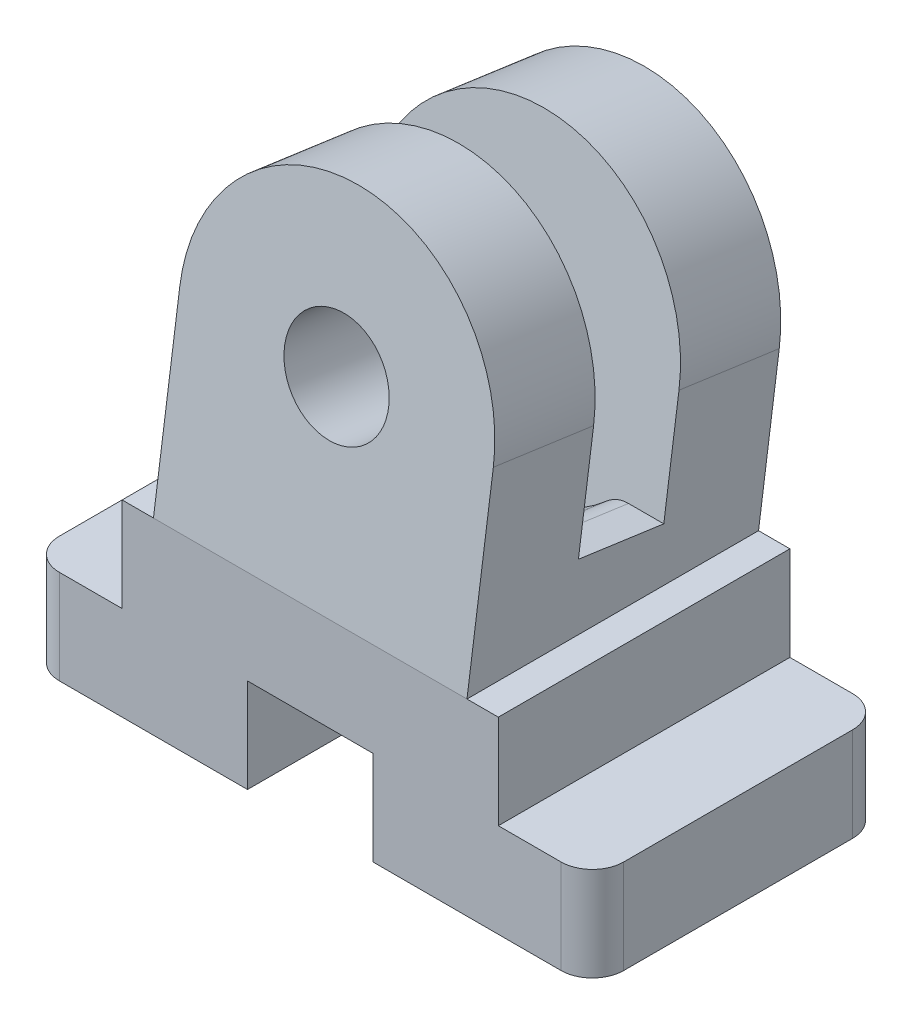
ISO-10303-21;
HEADER;
FILE_DESCRIPTION(('STEP AP214'),'2;1');
FILE_NAME('part.step','',(''),(''),'','','');
FILE_SCHEMA(('AUTOMOTIVE_DESIGN { 1 0 10303 214 1 1 1 1 }'));
ENDSEC;
DATA;
#1=APPLICATION_CONTEXT('core data for automotive mechanical design processes');
#2=APPLICATION_PROTOCOL_DEFINITION('international standard','automotive_design',2000,#1);
#3=PRODUCT_CONTEXT('',#1,'mechanical');
#4=PRODUCT('Part','Part','',(#3));
#5=PRODUCT_RELATED_PRODUCT_CATEGORY('part','',(#4));
#6=PRODUCT_DEFINITION_FORMATION('','',#4);
#7=PRODUCT_DEFINITION_CONTEXT('part definition',#1,'design');
#8=PRODUCT_DEFINITION('design','',#6,#7);
#9=PRODUCT_DEFINITION_SHAPE('','',#8);
#10=(LENGTH_UNIT() NAMED_UNIT(*) SI_UNIT(.MILLI.,.METRE.));
#11=(NAMED_UNIT(*) PLANE_ANGLE_UNIT() SI_UNIT($,.RADIAN.));
#12=(NAMED_UNIT(*) SI_UNIT($,.STERADIAN.) SOLID_ANGLE_UNIT());
#13=UNCERTAINTY_MEASURE_WITH_UNIT(LENGTH_MEASURE(1.E-05),#10,'distance_accuracy_value','');
#14=(GEOMETRIC_REPRESENTATION_CONTEXT(3) GLOBAL_UNCERTAINTY_ASSIGNED_CONTEXT((#13)) GLOBAL_UNIT_ASSIGNED_CONTEXT((#10,
#11,#12)) REPRESENTATION_CONTEXT('',''));
#15=CARTESIAN_POINT('',(0.,0.,0.));
#16=DIRECTION('',(0.,0.,1.));
#17=DIRECTION('',(1.,0.,0.));
#18=AXIS2_PLACEMENT_3D('',#15,#16,#17);
#19=CARTESIAN_POINT('',(-5.,0.307577926005134,2.18853066197066));
#20=DIRECTION('',(0.,0.139173100960066,0.99026806874157));
#21=DIRECTION('',(0.,-0.99026806874157,0.139173100960066));
#22=AXIS2_PLACEMENT_3D('',#19,#20,#21);
#23=PLANE('',#22);
#24=CARTESIAN_POINT('',(0.,11.5321199850963,0.611024151833874));
#25=DIRECTION('',(0.,0.139173100960066,0.99026806874157));
#26=DIRECTION('',(0.,-0.99026806874157,0.139173100960066));
#27=AXIS2_PLACEMENT_3D('',#24,#25,#26);
#28=CIRCLE('',#27,1.6625);
#29=CARTESIAN_POINT('',(0.,9.88579932081348,0.842399432179984));
#30=VERTEX_POINT('',#29);
#31=EDGE_CURVE('E585',#30,#30,#28,.T.);
#32=ORIENTED_EDGE('',*,*,#31,.T.);
#33=EDGE_LOOP('',(#32));
#34=FACE_BOUND('',#33,.T.);
#35=DIRECTION('',(1.,0.,0.));
#36=VECTOR('',#35,1.);
#37=CARTESIAN_POINT('',(3.48250089734375,8.08351054709297,1.09569460081341));
#38=LINE('',#37,#36);
#39=CARTESIAN_POINT('',(3.87463684818494,8.08351054709297,1.09569460081341));
#40=VERTEX_POINT('',#39);
#41=CARTESIAN_POINT('',(5.,8.08351054709297,1.09569460081341));
#42=VERTEX_POINT('',#41);
#43=EDGE_CURVE('E568',#40,#42,#38,.T.);
#44=ORIENTED_EDGE('',*,*,#43,.F.);
#45=CARTESIAN_POINT('',(3.87463684818494,7.0932424783514,1.23486770177348));
#46=DIRECTION('',(0.,0.139173100960066,0.99026806874157));
#47=DIRECTION('',(0.,-0.99026806874157,0.139173100960066));
#48=AXIS2_PLACEMENT_3D('',#45,#46,#47);
#49=CIRCLE('',#48,1.);
#50=CARTESIAN_POINT('',(3.22068970081196,7.84242011662059,1.12957765115076));
#51=VERTEX_POINT('',#50);
#52=EDGE_CURVE('E86',#40,#51,#49,.T.);
#53=ORIENTED_EDGE('',*,*,#52,.T.);
#54=CARTESIAN_POINT('',(0.,11.5321199850963,0.611024151833875));
#55=DIRECTION('',(0.,0.139173100960066,0.99026806874157));
#56=DIRECTION('',(0.,-0.99026806874157,0.139173100960066));
#57=AXIS2_PLACEMENT_3D('',#54,#55,#56);
#58=CIRCLE('',#57,4.925);
#59=CARTESIAN_POINT('',(-3.22068970081196,7.84242011662059,1.12957765115076));
#60=VERTEX_POINT('',#59);
#61=EDGE_CURVE('E567',#60,#51,#58,.T.);
#62=ORIENTED_EDGE('',*,*,#61,.F.);
#63=CARTESIAN_POINT('',(-3.87463684818494,7.0932424783514,1.23486770177348));
#64=DIRECTION('',(0.,0.139173100960066,0.99026806874157));
#65=DIRECTION('',(0.,-0.99026806874157,0.139173100960066));
#66=AXIS2_PLACEMENT_3D('',#63,#64,#65);
#67=CIRCLE('',#66,1.);
#68=CARTESIAN_POINT('',(-3.87463684818494,8.08351054709297,1.09569460081341));
#69=VERTEX_POINT('',#68);
#70=EDGE_CURVE('E561',#60,#69,#67,.T.);
#71=ORIENTED_EDGE('',*,*,#70,.T.);
#72=DIRECTION('',(1.,0.,0.));
#73=VECTOR('',#72,1.);
#74=CARTESIAN_POINT('',(-3.48250089734375,8.08351054709297,1.09569460081341));
#75=LINE('',#74,#73);
#76=CARTESIAN_POINT('',(-5.,8.08351054709297,1.09569460081341));
#77=VERTEX_POINT('',#76);
#78=EDGE_CURVE('E274',#77,#69,#75,.T.);
#79=ORIENTED_EDGE('',*,*,#78,.F.);
#80=DIRECTION('',(0.,-0.99026806874157,0.139173100960066));
#81=VECTOR('',#80,1.);
#82=CARTESIAN_POINT('',(-5.,0.307577926005134,2.18853066197066));
#83=LINE('',#82,#81);
#84=CARTESIAN_POINT('',(-5.,11.5321199850963,0.611024151833876));
#85=VERTEX_POINT('',#84);
#86=EDGE_CURVE('E270',#85,#77,#83,.T.);
#87=ORIENTED_EDGE('',*,*,#86,.F.);
#88=CARTESIAN_POINT('',(0.,11.5321199850963,0.611024151833877));
#89=DIRECTION('',(0.,0.139173100960066,0.99026806874157));
#90=DIRECTION('',(0.,-0.99026806874157,0.139173100960066));
#91=AXIS2_PLACEMENT_3D('',#88,#89,#90);
#92=CIRCLE('',#91,5.);
#93=CARTESIAN_POINT('',(5.,11.5321199850964,0.611024151833878));
#94=VERTEX_POINT('',#93);
#95=EDGE_CURVE('E459',#94,#85,#92,.T.);
#96=ORIENTED_EDGE('',*,*,#95,.F.);
#97=DIRECTION('',(0.,-0.99026806874157,0.139173100960066));
#98=VECTOR('',#97,1.);
#99=CARTESIAN_POINT('',(5.,0.307577926005134,2.18853066197066));
#100=LINE('',#99,#98);
#101=EDGE_CURVE('E321',#94,#42,#100,.T.);
#102=ORIENTED_EDGE('',*,*,#101,.T.);
#103=EDGE_LOOP('',(#44,#53,#62,#71,#79,#87,#96,#102));
#104=FACE_BOUND('',#103,.T.);
#105=ADVANCED_FACE('F78',(#34,#104),#23,.F.);
#106=CARTESIAN_POINT('',(-5.,-0.0751481016350465,-0.53470652706866));
#107=DIRECTION('',(0.,-0.139173100960066,-0.99026806874157));
#108=DIRECTION('',(0.,0.99026806874157,-0.139173100960066));
#109=AXIS2_PLACEMENT_3D('',#106,#107,#108);
#110=PLANE('',#109);
#111=CARTESIAN_POINT('',(0.,11.1493939574562,-2.11221303720544));
#112=DIRECTION('',(0.,-0.139173100960066,-0.99026806874157));
#113=DIRECTION('',(0.,0.99026806874157,-0.139173100960066));
#114=AXIS2_PLACEMENT_3D('',#111,#112,#113);
#115=CIRCLE('',#114,1.6625);
#116=CARTESIAN_POINT('',(0.,12.795714621739,-2.34358831755155));
#117=VERTEX_POINT('',#116);
#118=EDGE_CURVE('E582',#117,#117,#115,.T.);
#119=ORIENTED_EDGE('',*,*,#118,.T.);
#120=EDGE_LOOP('',(#119));
#121=FACE_BOUND('',#120,.T.);
#122=CARTESIAN_POINT('',(0.,11.1493939574562,-2.11221303720544));
#123=DIRECTION('',(0.,-0.139173100960066,-0.99026806874157));
#124=DIRECTION('',(0.,0.99026806874157,-0.139173100960066));
#125=AXIS2_PLACEMENT_3D('',#122,#123,#124);
#126=CIRCLE('',#125,4.925);
#127=CARTESIAN_POINT('',(-3.22068970081196,7.45969408898041,-1.59365953788855));
#128=VERTEX_POINT('',#127);
#129=CARTESIAN_POINT('',(3.22068970081196,7.45969408898041,-1.59365953788855));
#130=VERTEX_POINT('',#129);
#131=EDGE_CURVE('E283',#128,#130,#126,.F.);
#132=ORIENTED_EDGE('',*,*,#131,.T.);
#133=CARTESIAN_POINT('',(3.87463684818494,6.71051645071122,-1.48836948726584));
#134=DIRECTION('',(0.,-0.139173100960066,-0.99026806874157));
#135=DIRECTION('',(0.,0.99026806874157,-0.139173100960066));
#136=AXIS2_PLACEMENT_3D('',#133,#134,#135);
#137=CIRCLE('',#136,1.);
#138=CARTESIAN_POINT('',(3.87463684818494,7.70078451945279,-1.6275425882259));
#139=VERTEX_POINT('',#138);
#140=EDGE_CURVE('E12',#130,#139,#137,.T.);
#141=ORIENTED_EDGE('',*,*,#140,.T.);
#142=DIRECTION('',(1.,0.,0.));
#143=VECTOR('',#142,1.);
#144=CARTESIAN_POINT('',(3.48250089734375,7.70078451945279,-1.6275425882259));
#145=LINE('',#144,#143);
#146=CARTESIAN_POINT('',(5.,7.70078451945279,-1.6275425882259));
#147=VERTEX_POINT('',#146);
#148=EDGE_CURVE('E462',#139,#147,#145,.T.);
#149=ORIENTED_EDGE('',*,*,#148,.T.);
#150=DIRECTION('',(0.,0.99026806874157,-0.139173100960066));
#151=VECTOR('',#150,1.);
#152=CARTESIAN_POINT('',(5.,-0.0751481016350465,-0.53470652706866));
#153=LINE('',#152,#151);
#154=CARTESIAN_POINT('',(5.,11.1493939574562,-2.11221303720544));
#155=VERTEX_POINT('',#154);
#156=EDGE_CURVE('E296',#147,#155,#153,.T.);
#157=ORIENTED_EDGE('',*,*,#156,.T.);
#158=CARTESIAN_POINT('',(0.,11.1493939574562,-2.11221303720544));
#159=DIRECTION('',(0.,-0.139173100960066,-0.99026806874157));
#160=DIRECTION('',(0.,0.99026806874157,-0.139173100960066));
#161=AXIS2_PLACEMENT_3D('',#158,#159,#160);
#162=CIRCLE('',#161,5.);
#163=CARTESIAN_POINT('',(-5.,11.1493939574562,-2.11221303720544));
#164=VERTEX_POINT('',#163);
#165=EDGE_CURVE('E288',#164,#155,#162,.T.);
#166=ORIENTED_EDGE('',*,*,#165,.F.);
#167=DIRECTION('',(0.,0.99026806874157,-0.139173100960066));
#168=VECTOR('',#167,1.);
#169=CARTESIAN_POINT('',(-5.,-0.0751481016350465,-0.53470652706866));
#170=LINE('',#169,#168);
#171=CARTESIAN_POINT('',(-5.,7.70078451945279,-1.6275425882259));
#172=VERTEX_POINT('',#171);
#173=EDGE_CURVE('E266',#172,#164,#170,.T.);
#174=ORIENTED_EDGE('',*,*,#173,.F.);
#175=DIRECTION('',(1.,0.,0.));
#176=VECTOR('',#175,1.);
#177=CARTESIAN_POINT('',(-3.48250089734375,7.70078451945279,-1.6275425882259));
#178=LINE('',#177,#176);
#179=CARTESIAN_POINT('',(-3.87463684818494,7.70078451945279,-1.6275425882259));
#180=VERTEX_POINT('',#179);
#181=EDGE_CURVE('E278',#172,#180,#178,.T.);
#182=ORIENTED_EDGE('',*,*,#181,.T.);
#183=CARTESIAN_POINT('',(-3.87463684818494,6.71051645071122,-1.48836948726584));
#184=DIRECTION('',(0.,-0.139173100960066,-0.99026806874157));
#185=DIRECTION('',(0.,0.99026806874157,-0.139173100960066));
#186=AXIS2_PLACEMENT_3D('',#183,#184,#185);
#187=CIRCLE('',#186,1.);
#188=EDGE_CURVE('E563',#180,#128,#187,.T.);
#189=ORIENTED_EDGE('',*,*,#188,.T.);
#190=EDGE_LOOP('',(#132,#141,#149,#157,#166,#174,#182,#189));
#191=FACE_BOUND('',#190,.T.);
#192=ADVANCED_FACE('F286',(#121,#191),#110,.F.);
#193=CARTESIAN_POINT('',(0.,6.,0.));
#194=DIRECTION('',(0.,1.,0.));
#195=DIRECTION('',(0.,0.,1.));
#196=AXIS2_PLACEMENT_3D('',#193,#194,#195);
#197=PLANE('',#196);
#198=DIRECTION('',(-1.,0.,0.));
#199=VECTOR('',#198,1.);
#200=CARTESIAN_POINT('',(-6.,6.,-4.65));
#201=LINE('',#200,#199);
#202=CARTESIAN_POINT('',(6.,6.,-4.65));
#203=VERTEX_POINT('',#202);
#204=CARTESIAN_POINT('',(5.,6.,-4.65));
#205=VERTEX_POINT('',#204);
#206=EDGE_CURVE('E338',#203,#205,#201,.T.);
#207=ORIENTED_EDGE('',*,*,#206,.T.);
#208=DIRECTION('',(0.,0.,1.));
#209=VECTOR('',#208,1.);
#210=CARTESIAN_POINT('',(5.,6.,0.));
#211=LINE('',#210,#209);
#212=CARTESIAN_POINT('',(5.,6.,4.65));
#213=VERTEX_POINT('',#212);
#214=EDGE_CURVE('E326',#205,#213,#211,.T.);
#215=ORIENTED_EDGE('',*,*,#214,.T.);
#216=DIRECTION('',(1.,0.,0.));
#217=VECTOR('',#216,1.);
#218=CARTESIAN_POINT('',(-6.,6.,4.65));
#219=LINE('',#218,#217);
#220=CARTESIAN_POINT('',(6.,6.,4.65));
#221=VERTEX_POINT('',#220);
#222=EDGE_CURVE('E374',#213,#221,#219,.T.);
#223=ORIENTED_EDGE('',*,*,#222,.T.);
#224=DIRECTION('',(0.,0.,-1.));
#225=VECTOR('',#224,1.);
#226=CARTESIAN_POINT('',(6.,6.,-4.65));
#227=LINE('',#226,#225);
#228=EDGE_CURVE('E348',#221,#203,#227,.T.);
#229=ORIENTED_EDGE('',*,*,#228,.T.);
#230=EDGE_LOOP('',(#207,#215,#223,#229));
#231=FACE_BOUND('',#230,.T.);
#232=ADVANCED_FACE('F437',(#231),#197,.T.);
#233=DIRECTION('',(0.,0.,1.));
#234=VECTOR('',#233,1.);
#235=CARTESIAN_POINT('',(-5.,6.,0.));
#236=LINE('',#235,#234);
#237=CARTESIAN_POINT('',(-5.,6.,-4.65));
#238=VERTEX_POINT('',#237);
#239=CARTESIAN_POINT('',(-5.,6.,4.65));
#240=VERTEX_POINT('',#239);
#241=EDGE_CURVE('E335',#238,#240,#236,.T.);
#242=ORIENTED_EDGE('',*,*,#241,.F.);
#243=CARTESIAN_POINT('',(-6.,6.,-4.65));
#244=VERTEX_POINT('',#243);
#245=EDGE_CURVE('E343',#238,#244,#201,.T.);
#246=ORIENTED_EDGE('',*,*,#245,.T.);
#247=DIRECTION('',(0.,0.,1.));
#248=VECTOR('',#247,1.);
#249=CARTESIAN_POINT('',(-6.,6.,-4.65));
#250=LINE('',#249,#248);
#251=CARTESIAN_POINT('',(-6.,6.,4.65));
#252=VERTEX_POINT('',#251);
#253=EDGE_CURVE('E360',#244,#252,#250,.T.);
#254=ORIENTED_EDGE('',*,*,#253,.T.);
#255=EDGE_CURVE('E370',#252,#240,#219,.T.);
#256=ORIENTED_EDGE('',*,*,#255,.T.);
#257=EDGE_LOOP('',(#242,#246,#254,#256));
#258=FACE_BOUND('',#257,.T.);
#259=ADVANCED_FACE('F393',(#258),#197,.T.);
#260=CARTESIAN_POINT('',(0.,3.,0.));
#261=DIRECTION('',(0.,1.,0.));
#262=DIRECTION('',(0.,0.,1.));
#263=AXIS2_PLACEMENT_3D('',#260,#261,#262);
#264=PLANE('',#263);
#265=DIRECTION('',(0.,0.,-1.));
#266=VECTOR('',#265,1.);
#267=CARTESIAN_POINT('',(9.,3.,-4.65));
#268=LINE('',#267,#266);
#269=CARTESIAN_POINT('',(9.,3.,3.65));
#270=VERTEX_POINT('',#269);
#271=CARTESIAN_POINT('',(9.,3.,-3.65));
#272=VERTEX_POINT('',#271);
#273=EDGE_CURVE('E471',#270,#272,#268,.T.);
#274=ORIENTED_EDGE('',*,*,#273,.T.);
#275=CARTESIAN_POINT('',(8.,3.,-3.65));
#276=DIRECTION('',(0.,1.,0.));
#277=DIRECTION('',(0.,0.,1.));
#278=AXIS2_PLACEMENT_3D('',#275,#276,#277);
#279=CIRCLE('',#278,1.);
#280=CARTESIAN_POINT('',(8.,3.,-4.65));
#281=VERTEX_POINT('',#280);
#282=EDGE_CURVE('E301',#272,#281,#279,.T.);
#283=ORIENTED_EDGE('',*,*,#282,.T.);
#284=DIRECTION('',(-1.,0.,0.));
#285=VECTOR('',#284,1.);
#286=CARTESIAN_POINT('',(-9.,3.,-4.65));
#287=LINE('',#286,#285);
#288=CARTESIAN_POINT('',(6.,3.,-4.65));
#289=VERTEX_POINT('',#288);
#290=EDGE_CURVE('E467',#281,#289,#287,.T.);
#291=ORIENTED_EDGE('',*,*,#290,.T.);
#292=DIRECTION('',(0.,0.,-1.));
#293=VECTOR('',#292,1.);
#294=CARTESIAN_POINT('',(6.,3.,-4.65));
#295=LINE('',#294,#293);
#296=CARTESIAN_POINT('',(6.,3.,4.65));
#297=VERTEX_POINT('',#296);
#298=EDGE_CURVE('E356',#297,#289,#295,.T.);
#299=ORIENTED_EDGE('',*,*,#298,.F.);
#300=DIRECTION('',(1.,0.,0.));
#301=VECTOR('',#300,1.);
#302=CARTESIAN_POINT('',(-9.,3.,4.65));
#303=LINE('',#302,#301);
#304=CARTESIAN_POINT('',(8.,3.,4.65));
#305=VERTEX_POINT('',#304);
#306=EDGE_CURVE('E622',#297,#305,#303,.T.);
#307=ORIENTED_EDGE('',*,*,#306,.T.);
#308=CARTESIAN_POINT('',(8.,3.,3.65));
#309=DIRECTION('',(0.,1.,0.));
#310=DIRECTION('',(0.,0.,1.));
#311=AXIS2_PLACEMENT_3D('',#308,#309,#310);
#312=CIRCLE('',#311,1.);
#313=EDGE_CURVE('E544',#305,#270,#312,.T.);
#314=ORIENTED_EDGE('',*,*,#313,.T.);
#315=EDGE_LOOP('',(#274,#283,#291,#299,#307,#314));
#316=FACE_BOUND('',#315,.T.);
#317=ADVANCED_FACE('F663',(#316),#264,.T.);
#318=CARTESIAN_POINT('',(0.,0.,0.));
#319=DIRECTION('',(0.,1.,0.));
#320=DIRECTION('',(0.,0.,1.));
#321=AXIS2_PLACEMENT_3D('',#318,#319,#320);
#322=PLANE('',#321);
#323=DIRECTION('',(-1.,0.,0.));
#324=VECTOR('',#323,1.);
#325=CARTESIAN_POINT('',(-9.,0.,-4.65));
#326=LINE('',#325,#324);
#327=CARTESIAN_POINT('',(8.,0.,-4.65));
#328=VERTEX_POINT('',#327);
#329=CARTESIAN_POINT('',(2.,0.,-4.65));
#330=VERTEX_POINT('',#329);
#331=EDGE_CURVE('E487',#328,#330,#326,.T.);
#332=ORIENTED_EDGE('',*,*,#331,.F.);
#333=CARTESIAN_POINT('',(8.,0.,-3.65));
#334=DIRECTION('',(0.,1.,0.));
#335=DIRECTION('',(0.,0.,1.));
#336=AXIS2_PLACEMENT_3D('',#333,#334,#335);
#337=CIRCLE('',#336,1.);
#338=CARTESIAN_POINT('',(9.,0.,-3.65));
#339=VERTEX_POINT('',#338);
#340=EDGE_CURVE('E538',#328,#339,#337,.F.);
#341=ORIENTED_EDGE('',*,*,#340,.T.);
#342=DIRECTION('',(0.,0.,-1.));
#343=VECTOR('',#342,1.);
#344=CARTESIAN_POINT('',(9.,0.,-4.65));
#345=LINE('',#344,#343);
#346=CARTESIAN_POINT('',(9.,0.,3.65));
#347=VERTEX_POINT('',#346);
#348=EDGE_CURVE('E492',#347,#339,#345,.T.);
#349=ORIENTED_EDGE('',*,*,#348,.F.);
#350=CARTESIAN_POINT('',(8.,0.,3.65));
#351=DIRECTION('',(0.,1.,0.));
#352=DIRECTION('',(0.,0.,1.));
#353=AXIS2_PLACEMENT_3D('',#350,#351,#352);
#354=CIRCLE('',#353,1.);
#355=CARTESIAN_POINT('',(8.,0.,4.65));
#356=VERTEX_POINT('',#355);
#357=EDGE_CURVE('E536',#347,#356,#354,.F.);
#358=ORIENTED_EDGE('',*,*,#357,.T.);
#359=DIRECTION('',(1.,0.,0.));
#360=VECTOR('',#359,1.);
#361=CARTESIAN_POINT('',(-9.,0.,4.65));
#362=LINE('',#361,#360);
#363=CARTESIAN_POINT('',(2.,0.,4.65));
#364=VERTEX_POINT('',#363);
#365=EDGE_CURVE('E495',#364,#356,#362,.T.);
#366=ORIENTED_EDGE('',*,*,#365,.F.);
#367=DIRECTION('',(0.,0.,1.));
#368=VECTOR('',#367,1.);
#369=CARTESIAN_POINT('',(2.,0.,4.65));
#370=LINE('',#369,#368);
#371=EDGE_CURVE('E589',#330,#364,#370,.T.);
#372=ORIENTED_EDGE('',*,*,#371,.F.);
#373=EDGE_LOOP('',(#332,#341,#349,#358,#366,#372));
#374=FACE_BOUND('',#373,.T.);
#375=ADVANCED_FACE('F613',(#374),#322,.F.);
#376=CARTESIAN_POINT('',(-5.,0.757071764459568,5.38684551050759));
#377=DIRECTION('',(0.,-0.139173100960066,-0.99026806874157));
#378=DIRECTION('',(0.,0.99026806874157,-0.139173100960066));
#379=AXIS2_PLACEMENT_3D('',#376,#377,#378);
#380=PLANE('',#379);
#381=CARTESIAN_POINT('',(0.,11.9816138235508,3.80933900037081));
#382=DIRECTION('',(0.,0.139173100960066,0.99026806874157));
#383=DIRECTION('',(0.,-0.99026806874157,0.139173100960066));
#384=AXIS2_PLACEMENT_3D('',#381,#382,#383);
#385=CIRCLE('',#384,1.6625);
#386=CARTESIAN_POINT('',(0.,10.3352931592679,4.04071428071692));
#387=VERTEX_POINT('',#386);
#388=EDGE_CURVE('E574',#387,#387,#385,.T.);
#389=ORIENTED_EDGE('',*,*,#388,.F.);
#390=EDGE_LOOP('',(#389));
#391=FACE_BOUND('',#390,.T.);
#392=DIRECTION('',(0.,0.99026806874157,-0.139173100960066));
#393=VECTOR('',#392,1.);
#394=CARTESIAN_POINT('',(5.,0.757071764459568,5.38684551050759));
#395=LINE('',#394,#393);
#396=CARTESIAN_POINT('',(5.,11.9816138235508,3.80933900037081));
#397=VERTEX_POINT('',#396);
#398=EDGE_CURVE('E325',#213,#397,#395,.T.);
#399=ORIENTED_EDGE('',*,*,#398,.T.);
#400=CARTESIAN_POINT('',(0.,11.9816138235508,3.80933900037081));
#401=DIRECTION('',(0.,0.139173100960066,0.99026806874157));
#402=DIRECTION('',(0.,-0.99026806874157,0.139173100960066));
#403=AXIS2_PLACEMENT_3D('',#400,#401,#402);
#404=CIRCLE('',#403,5.);
#405=CARTESIAN_POINT('',(-5.,11.9816138235508,3.80933900037081));
#406=VERTEX_POINT('',#405);
#407=EDGE_CURVE('E423',#397,#406,#404,.T.);
#408=ORIENTED_EDGE('',*,*,#407,.T.);
#409=DIRECTION('',(0.,0.99026806874157,-0.139173100960066));
#410=VECTOR('',#409,1.);
#411=CARTESIAN_POINT('',(-5.,0.757071764459568,5.38684551050759));
#412=LINE('',#411,#410);
#413=EDGE_CURVE('E418',#240,#406,#412,.T.);
#414=ORIENTED_EDGE('',*,*,#413,.F.);
#415=DIRECTION('',(1.,0.,0.));
#416=VECTOR('',#415,1.);
#417=CARTESIAN_POINT('',(-5.,6.,4.65));
#418=LINE('',#417,#416);
#419=EDGE_CURVE('E413',#240,#213,#418,.T.);
#420=ORIENTED_EDGE('',*,*,#419,.T.);
#421=EDGE_LOOP('',(#399,#408,#414,#420));
#422=FACE_BOUND('',#421,.T.);
#423=ADVANCED_FACE('F422',(#391,#422),#380,.F.);
#424=CARTESIAN_POINT('',(-5.,-0.52464194008948,-3.73302137560559));
#425=DIRECTION('',(0.,0.139173100960066,0.99026806874157));
#426=DIRECTION('',(0.,-0.99026806874157,0.139173100960066));
#427=AXIS2_PLACEMENT_3D('',#424,#425,#426);
#428=PLANE('',#427);
#429=CARTESIAN_POINT('',(0.,10.6999001190017,-5.31052788574237));
#430=DIRECTION('',(0.,0.139173100960066,0.99026806874157));
#431=DIRECTION('',(0.,-0.99026806874157,0.139173100960066));
#432=AXIS2_PLACEMENT_3D('',#429,#430,#431);
#433=CIRCLE('',#432,1.6625);
#434=CARTESIAN_POINT('',(0.,9.05357945471887,-5.07915260539626));
#435=VERTEX_POINT('',#434);
#436=EDGE_CURVE('E327',#435,#435,#433,.T.);
#437=ORIENTED_EDGE('',*,*,#436,.T.);
#438=EDGE_LOOP('',(#437));
#439=FACE_BOUND('',#438,.T.);
#440=CARTESIAN_POINT('',(0.,10.6999001190017,-5.31052788574237));
#441=DIRECTION('',(0.,0.139173100960066,0.99026806874157));
#442=DIRECTION('',(0.,-0.99026806874157,0.139173100960066));
#443=AXIS2_PLACEMENT_3D('',#440,#441,#442);
#444=CIRCLE('',#443,5.);
#445=CARTESIAN_POINT('',(5.,10.6999001190017,-5.31052788574237));
#446=VERTEX_POINT('',#445);
#447=CARTESIAN_POINT('',(-5.,10.6999001190017,-5.31052788574237));
#448=VERTEX_POINT('',#447);
#449=EDGE_CURVE('E456',#446,#448,#444,.T.);
#450=ORIENTED_EDGE('',*,*,#449,.F.);
#451=DIRECTION('',(0.,-0.99026806874157,0.139173100960066));
#452=VECTOR('',#451,1.);
#453=CARTESIAN_POINT('',(5.,-0.52464194008948,-3.73302137560559));
#454=LINE('',#453,#452);
#455=EDGE_CURVE('E290',#446,#205,#454,.T.);
#456=ORIENTED_EDGE('',*,*,#455,.T.);
#457=DIRECTION('',(1.,0.,0.));
#458=VECTOR('',#457,1.);
#459=CARTESIAN_POINT('',(-5.,6.,-4.65));
#460=LINE('',#459,#458);
#461=EDGE_CURVE('E293',#238,#205,#460,.T.);
#462=ORIENTED_EDGE('',*,*,#461,.F.);
#463=DIRECTION('',(0.,-0.99026806874157,0.139173100960066));
#464=VECTOR('',#463,1.);
#465=CARTESIAN_POINT('',(-5.,-0.52464194008948,-3.73302137560559));
#466=LINE('',#465,#464);
#467=EDGE_CURVE('E289',#448,#238,#466,.T.);
#468=ORIENTED_EDGE('',*,*,#467,.F.);
#469=EDGE_LOOP('',(#450,#456,#462,#468));
#470=FACE_BOUND('',#469,.T.);
#471=ADVANCED_FACE('F433',(#439,#470),#428,.F.);
#472=CARTESIAN_POINT('',(5.,0.,0.));
#473=DIRECTION('',(1.,0.,0.));
#474=DIRECTION('',(0.,0.,-1.));
#475=AXIS2_PLACEMENT_3D('',#472,#473,#474);
#476=PLANE('',#475);
#477=ORIENTED_EDGE('',*,*,#455,.F.);
#478=DIRECTION('',(0.,0.139173100960066,0.99026806874157));
#479=VECTOR('',#478,1.);
#480=CARTESIAN_POINT('',(5.,10.3967454175413,-7.46758566971223));
#481=LINE('',#480,#479);
#482=EDGE_CURVE('E316',#446,#155,#481,.T.);
#483=ORIENTED_EDGE('',*,*,#482,.T.);
#484=ORIENTED_EDGE('',*,*,#156,.F.);
#485=DIRECTION('',(0.,0.139173100960066,0.99026806874157));
#486=VECTOR('',#485,1.);
#487=CARTESIAN_POINT('',(5.,6.27858278742775,-11.7470337313992));
#488=LINE('',#487,#486);
#489=EDGE_CURVE('E275',#147,#42,#488,.T.);
#490=ORIENTED_EDGE('',*,*,#489,.T.);
#491=ORIENTED_EDGE('',*,*,#101,.F.);
#492=DIRECTION('',(0.,0.139173100960066,0.99026806874157));
#493=VECTOR('',#492,1.);
#494=CARTESIAN_POINT('',(5.,10.3967454175413,-7.46758566971223));
#495=LINE('',#494,#493);
#496=EDGE_CURVE('E443',#94,#397,#495,.T.);
#497=ORIENTED_EDGE('',*,*,#496,.T.);
#498=ORIENTED_EDGE('',*,*,#398,.F.);
#499=ORIENTED_EDGE('',*,*,#214,.F.);
#500=EDGE_LOOP('',(#477,#483,#484,#490,#491,#497,#498,#499));
#501=FACE_BOUND('',#500,.T.);
#502=ADVANCED_FACE('F439',(#501),#476,.T.);
#503=CARTESIAN_POINT('',(-5.,0.,0.));
#504=DIRECTION('',(1.,0.,0.));
#505=DIRECTION('',(0.,0.,-1.));
#506=AXIS2_PLACEMENT_3D('',#503,#504,#505);
#507=PLANE('',#506);
#508=DIRECTION('',(0.,0.139173100960066,0.99026806874157));
#509=VECTOR('',#508,1.);
#510=CARTESIAN_POINT('',(-5.,10.3967454175413,-7.46758566971223));
#511=LINE('',#510,#509);
#512=EDGE_CURVE('E320',#448,#164,#511,.T.);
#513=ORIENTED_EDGE('',*,*,#512,.F.);
#514=ORIENTED_EDGE('',*,*,#467,.T.);
#515=ORIENTED_EDGE('',*,*,#241,.T.);
#516=ORIENTED_EDGE('',*,*,#413,.T.);
#517=DIRECTION('',(0.,0.139173100960066,0.99026806874157));
#518=VECTOR('',#517,1.);
#519=CARTESIAN_POINT('',(-5.,10.3967454175413,-7.46758566971223));
#520=LINE('',#519,#518);
#521=EDGE_CURVE('E448',#85,#406,#520,.T.);
#522=ORIENTED_EDGE('',*,*,#521,.F.);
#523=ORIENTED_EDGE('',*,*,#86,.T.);
#524=DIRECTION('',(0.,0.139173100960066,0.99026806874157));
#525=VECTOR('',#524,1.);
#526=CARTESIAN_POINT('',(-5.,6.27858278742775,-11.7470337313992));
#527=LINE('',#526,#525);
#528=EDGE_CURVE('E261',#172,#77,#527,.T.);
#529=ORIENTED_EDGE('',*,*,#528,.F.);
#530=ORIENTED_EDGE('',*,*,#173,.T.);
#531=EDGE_LOOP('',(#513,#514,#515,#516,#522,#523,#529,#530));
#532=FACE_BOUND('',#531,.T.);
#533=ADVANCED_FACE('F264',(#532),#507,.F.);
#534=CARTESIAN_POINT('',(-6.,3.,-4.65));
#535=VERTEX_POINT('',#534);
#536=CARTESIAN_POINT('',(-8.,3.,-4.65));
#537=VERTEX_POINT('',#536);
#538=EDGE_CURVE('E402',#535,#537,#287,.T.);
#539=ORIENTED_EDGE('',*,*,#538,.T.);
#540=CARTESIAN_POINT('',(-8.,3.,-3.65));
#541=DIRECTION('',(0.,1.,0.));
#542=DIRECTION('',(0.,0.,1.));
#543=AXIS2_PLACEMENT_3D('',#540,#541,#542);
#544=CIRCLE('',#543,1.);
#545=CARTESIAN_POINT('',(-9.,3.,-3.65));
#546=VERTEX_POINT('',#545);
#547=EDGE_CURVE('E528',#537,#546,#544,.T.);
#548=ORIENTED_EDGE('',*,*,#547,.T.);
#549=DIRECTION('',(0.,0.,1.));
#550=VECTOR('',#549,1.);
#551=CARTESIAN_POINT('',(-9.,3.,-4.65));
#552=LINE('',#551,#550);
#553=CARTESIAN_POINT('',(-9.,3.,3.65));
#554=VERTEX_POINT('',#553);
#555=EDGE_CURVE('E353',#546,#554,#552,.T.);
#556=ORIENTED_EDGE('',*,*,#555,.T.);
#557=CARTESIAN_POINT('',(-8.,3.,3.65));
#558=DIRECTION('',(0.,1.,0.));
#559=DIRECTION('',(0.,0.,1.));
#560=AXIS2_PLACEMENT_3D('',#557,#558,#559);
#561=CIRCLE('',#560,1.);
#562=CARTESIAN_POINT('',(-8.,3.,4.65));
#563=VERTEX_POINT('',#562);
#564=EDGE_CURVE('E520',#554,#563,#561,.T.);
#565=ORIENTED_EDGE('',*,*,#564,.T.);
#566=CARTESIAN_POINT('',(-6.,3.,4.65));
#567=VERTEX_POINT('',#566);
#568=EDGE_CURVE('E621',#563,#567,#303,.T.);
#569=ORIENTED_EDGE('',*,*,#568,.T.);
#570=DIRECTION('',(0.,0.,1.));
#571=VECTOR('',#570,1.);
#572=CARTESIAN_POINT('',(-6.,3.,-4.65));
#573=LINE('',#572,#571);
#574=EDGE_CURVE('E361',#535,#567,#573,.T.);
#575=ORIENTED_EDGE('',*,*,#574,.F.);
#576=EDGE_LOOP('',(#539,#548,#556,#565,#569,#575));
#577=FACE_BOUND('',#576,.T.);
#578=ADVANCED_FACE('F625',(#577),#264,.T.);
#579=CARTESIAN_POINT('',(-9.,3.,-4.65));
#580=DIRECTION('',(1.,0.,0.));
#581=DIRECTION('',(0.,0.,-1.));
#582=AXIS2_PLACEMENT_3D('',#579,#580,#581);
#583=PLANE('',#582);
#584=ORIENTED_EDGE('',*,*,#555,.F.);
#585=DIRECTION('',(0.,-1.,0.));
#586=VECTOR('',#585,1.);
#587=CARTESIAN_POINT('',(-9.,3.,-3.65));
#588=LINE('',#587,#586);
#589=CARTESIAN_POINT('',(-9.,0.,-3.65));
#590=VERTEX_POINT('',#589);
#591=EDGE_CURVE('E513',#546,#590,#588,.T.);
#592=ORIENTED_EDGE('',*,*,#591,.T.);
#593=DIRECTION('',(0.,0.,1.));
#594=VECTOR('',#593,1.);
#595=CARTESIAN_POINT('',(-9.,0.,-4.65));
#596=LINE('',#595,#594);
#597=CARTESIAN_POINT('',(-9.,0.,3.65));
#598=VERTEX_POINT('',#597);
#599=EDGE_CURVE('E367',#590,#598,#596,.T.);
#600=ORIENTED_EDGE('',*,*,#599,.T.);
#601=DIRECTION('',(0.,-1.,0.));
#602=VECTOR('',#601,1.);
#603=CARTESIAN_POINT('',(-9.,3.,3.65));
#604=LINE('',#603,#602);
#605=EDGE_CURVE('E319',#598,#554,#604,.F.);
#606=ORIENTED_EDGE('',*,*,#605,.T.);
#607=EDGE_LOOP('',(#584,#592,#600,#606));
#608=FACE_BOUND('',#607,.T.);
#609=ADVANCED_FACE('F510',(#608),#583,.F.);
#610=CARTESIAN_POINT('',(-9.,3.,4.65));
#611=DIRECTION('',(0.,0.,-1.));
#612=DIRECTION('',(-1.,0.,0.));
#613=AXIS2_PLACEMENT_3D('',#610,#611,#612);
#614=PLANE('',#613);
#615=ORIENTED_EDGE('',*,*,#568,.F.);
#616=DIRECTION('',(0.,-1.,0.));
#617=VECTOR('',#616,1.);
#618=CARTESIAN_POINT('',(-8.,3.,4.65));
#619=LINE('',#618,#617);
#620=CARTESIAN_POINT('',(-8.,0.,4.65));
#621=VERTEX_POINT('',#620);
#622=EDGE_CURVE('E534',#563,#621,#619,.T.);
#623=ORIENTED_EDGE('',*,*,#622,.T.);
#624=CARTESIAN_POINT('',(-2.,0.,4.65));
#625=VERTEX_POINT('',#624);
#626=EDGE_CURVE('E494',#621,#625,#362,.T.);
#627=ORIENTED_EDGE('',*,*,#626,.T.);
#628=DIRECTION('',(0.,-1.,0.));
#629=VECTOR('',#628,1.);
#630=CARTESIAN_POINT('',(-2.,13.1237344888139,4.65));
#631=LINE('',#630,#629);
#632=CARTESIAN_POINT('',(-2.,3.,4.65));
#633=VERTEX_POINT('',#632);
#634=EDGE_CURVE('E597',#633,#625,#631,.T.);
#635=ORIENTED_EDGE('',*,*,#634,.F.);
#636=DIRECTION('',(-1.,0.,0.));
#637=VECTOR('',#636,1.);
#638=CARTESIAN_POINT('',(-2.,3.,4.65));
#639=LINE('',#638,#637);
#640=CARTESIAN_POINT('',(2.,3.,4.65));
#641=VERTEX_POINT('',#640);
#642=EDGE_CURVE('E598',#641,#633,#639,.T.);
#643=ORIENTED_EDGE('',*,*,#642,.F.);
#644=DIRECTION('',(0.,-1.,0.));
#645=VECTOR('',#644,1.);
#646=CARTESIAN_POINT('',(2.,13.1237344888139,4.65));
#647=LINE('',#646,#645);
#648=EDGE_CURVE('E601',#641,#364,#647,.T.);
#649=ORIENTED_EDGE('',*,*,#648,.T.);
#650=ORIENTED_EDGE('',*,*,#365,.T.);
#651=DIRECTION('',(0.,-1.,0.));
#652=VECTOR('',#651,1.);
#653=CARTESIAN_POINT('',(8.,3.,4.65));
#654=LINE('',#653,#652);
#655=EDGE_CURVE('E532',#356,#305,#654,.F.);
#656=ORIENTED_EDGE('',*,*,#655,.T.);
#657=ORIENTED_EDGE('',*,*,#306,.F.);
#658=DIRECTION('',(0.,-1.,0.));
#659=VECTOR('',#658,1.);
#660=CARTESIAN_POINT('',(6.,6.,4.65));
#661=LINE('',#660,#659);
#662=EDGE_CURVE('E383',#221,#297,#661,.T.);
#663=ORIENTED_EDGE('',*,*,#662,.F.);
#664=ORIENTED_EDGE('',*,*,#222,.F.);
#665=ORIENTED_EDGE('',*,*,#419,.F.);
#666=ORIENTED_EDGE('',*,*,#255,.F.);
#667=DIRECTION('',(0.,-1.,0.));
#668=VECTOR('',#667,1.);
#669=CARTESIAN_POINT('',(-6.,6.,4.65));
#670=LINE('',#669,#668);
#671=EDGE_CURVE('E373',#252,#567,#670,.T.);
#672=ORIENTED_EDGE('',*,*,#671,.T.);
#673=EDGE_LOOP('',(#615,#623,#627,#635,#643,#649,#650,#656,#657,#663,#664,#665,#666,#672));
#674=FACE_BOUND('',#673,.T.);
#675=ADVANCED_FACE('F410',(#674),#614,.F.);
#676=CARTESIAN_POINT('',(9.,3.,-4.65));
#677=DIRECTION('',(-1.,0.,0.));
#678=DIRECTION('',(0.,0.,1.));
#679=AXIS2_PLACEMENT_3D('',#676,#677,#678);
#680=PLANE('',#679);
#681=ORIENTED_EDGE('',*,*,#348,.T.);
#682=DIRECTION('',(0.,-1.,0.));
#683=VECTOR('',#682,1.);
#684=CARTESIAN_POINT('',(9.,3.,-3.65));
#685=LINE('',#684,#683);
#686=EDGE_CURVE('E543',#339,#272,#685,.F.);
#687=ORIENTED_EDGE('',*,*,#686,.T.);
#688=ORIENTED_EDGE('',*,*,#273,.F.);
#689=DIRECTION('',(0.,-1.,0.));
#690=VECTOR('',#689,1.);
#691=CARTESIAN_POINT('',(9.,3.,3.65));
#692=LINE('',#691,#690);
#693=EDGE_CURVE('E540',#270,#347,#692,.T.);
#694=ORIENTED_EDGE('',*,*,#693,.T.);
#695=EDGE_LOOP('',(#681,#687,#688,#694));
#696=FACE_BOUND('',#695,.T.);
#697=ADVANCED_FACE('F619',(#696),#680,.F.);
#698=CARTESIAN_POINT('',(-9.,3.,-4.65));
#699=DIRECTION('',(0.,0.,1.));
#700=DIRECTION('',(1.,0.,0.));
#701=AXIS2_PLACEMENT_3D('',#698,#699,#700);
#702=PLANE('',#701);
#703=CARTESIAN_POINT('',(-2.,0.,-4.65));
#704=VERTEX_POINT('',#703);
#705=CARTESIAN_POINT('',(-8.,0.,-4.65));
#706=VERTEX_POINT('',#705);
#707=EDGE_CURVE('E491',#704,#706,#326,.T.);
#708=ORIENTED_EDGE('',*,*,#707,.T.);
#709=DIRECTION('',(0.,-1.,0.));
#710=VECTOR('',#709,1.);
#711=CARTESIAN_POINT('',(-8.,3.,-4.65));
#712=LINE('',#711,#710);
#713=EDGE_CURVE('E524',#706,#537,#712,.F.);
#714=ORIENTED_EDGE('',*,*,#713,.T.);
#715=ORIENTED_EDGE('',*,*,#538,.F.);
#716=DIRECTION('',(0.,-1.,0.));
#717=VECTOR('',#716,1.);
#718=CARTESIAN_POINT('',(-6.,6.,-4.65));
#719=LINE('',#718,#717);
#720=EDGE_CURVE('E342',#244,#535,#719,.T.);
#721=ORIENTED_EDGE('',*,*,#720,.F.);
#722=ORIENTED_EDGE('',*,*,#245,.F.);
#723=ORIENTED_EDGE('',*,*,#461,.T.);
#724=ORIENTED_EDGE('',*,*,#206,.F.);
#725=DIRECTION('',(0.,-1.,0.));
#726=VECTOR('',#725,1.);
#727=CARTESIAN_POINT('',(6.,6.,-4.65));
#728=LINE('',#727,#726);
#729=EDGE_CURVE('E364',#203,#289,#728,.T.);
#730=ORIENTED_EDGE('',*,*,#729,.T.);
#731=ORIENTED_EDGE('',*,*,#290,.F.);
#732=DIRECTION('',(0.,-1.,0.));
#733=VECTOR('',#732,1.);
#734=CARTESIAN_POINT('',(8.,3.,-4.65));
#735=LINE('',#734,#733);
#736=EDGE_CURVE('E478',#281,#328,#735,.T.);
#737=ORIENTED_EDGE('',*,*,#736,.T.);
#738=ORIENTED_EDGE('',*,*,#331,.T.);
#739=DIRECTION('',(0.,-1.,0.));
#740=VECTOR('',#739,1.);
#741=CARTESIAN_POINT('',(2.,13.1237344888139,-4.65));
#742=LINE('',#741,#740);
#743=CARTESIAN_POINT('',(2.,3.,-4.65));
#744=VERTEX_POINT('',#743);
#745=EDGE_CURVE('E595',#744,#330,#742,.T.);
#746=ORIENTED_EDGE('',*,*,#745,.F.);
#747=DIRECTION('',(1.,0.,0.));
#748=VECTOR('',#747,1.);
#749=CARTESIAN_POINT('',(-2.,3.,-4.65));
#750=LINE('',#749,#748);
#751=CARTESIAN_POINT('',(-2.,3.,-4.65));
#752=VERTEX_POINT('',#751);
#753=EDGE_CURVE('E591',#752,#744,#750,.T.);
#754=ORIENTED_EDGE('',*,*,#753,.F.);
#755=DIRECTION('',(0.,-1.,0.));
#756=VECTOR('',#755,1.);
#757=CARTESIAN_POINT('',(-2.,13.1237344888139,-4.65));
#758=LINE('',#757,#756);
#759=EDGE_CURVE('E446',#752,#704,#758,.T.);
#760=ORIENTED_EDGE('',*,*,#759,.T.);
#761=EDGE_LOOP('',(#708,#714,#715,#721,#722,#723,#724,#730,#731,#737,#738,#746,#754,#760));
#762=FACE_BOUND('',#761,.T.);
#763=ADVANCED_FACE('F400',(#762),#702,.F.);
#764=ORIENTED_EDGE('',*,*,#599,.F.);
#765=CARTESIAN_POINT('',(-8.,0.,-3.65));
#766=DIRECTION('',(0.,1.,0.));
#767=DIRECTION('',(0.,0.,1.));
#768=AXIS2_PLACEMENT_3D('',#765,#766,#767);
#769=CIRCLE('',#768,1.);
#770=EDGE_CURVE('E476',#590,#706,#769,.F.);
#771=ORIENTED_EDGE('',*,*,#770,.T.);
#772=ORIENTED_EDGE('',*,*,#707,.F.);
#773=DIRECTION('',(0.,0.,-1.));
#774=VECTOR('',#773,1.);
#775=CARTESIAN_POINT('',(-2.,0.,4.65));
#776=LINE('',#775,#774);
#777=EDGE_CURVE('E588',#625,#704,#776,.T.);
#778=ORIENTED_EDGE('',*,*,#777,.F.);
#779=ORIENTED_EDGE('',*,*,#626,.F.);
#780=CARTESIAN_POINT('',(-8.,0.,3.65));
#781=DIRECTION('',(0.,1.,0.));
#782=DIRECTION('',(0.,0.,1.));
#783=AXIS2_PLACEMENT_3D('',#780,#781,#782);
#784=CIRCLE('',#783,1.);
#785=EDGE_CURVE('E519',#621,#598,#784,.F.);
#786=ORIENTED_EDGE('',*,*,#785,.T.);
#787=EDGE_LOOP('',(#764,#771,#772,#778,#779,#786));
#788=FACE_BOUND('',#787,.T.);
#789=ADVANCED_FACE('F660',(#788),#322,.F.);
#790=CARTESIAN_POINT('',(-6.,6.,-4.65));
#791=DIRECTION('',(1.,0.,0.));
#792=DIRECTION('',(0.,0.,-1.));
#793=AXIS2_PLACEMENT_3D('',#790,#791,#792);
#794=PLANE('',#793);
#795=ORIENTED_EDGE('',*,*,#574,.T.);
#796=ORIENTED_EDGE('',*,*,#671,.F.);
#797=ORIENTED_EDGE('',*,*,#253,.F.);
#798=ORIENTED_EDGE('',*,*,#720,.T.);
#799=EDGE_LOOP('',(#795,#796,#797,#798));
#800=FACE_BOUND('',#799,.T.);
#801=ADVANCED_FACE('F405',(#800),#794,.F.);
#802=CARTESIAN_POINT('',(6.,6.,-4.65));
#803=DIRECTION('',(-1.,0.,0.));
#804=DIRECTION('',(0.,0.,1.));
#805=AXIS2_PLACEMENT_3D('',#802,#803,#804);
#806=PLANE('',#805);
#807=ORIENTED_EDGE('',*,*,#298,.T.);
#808=ORIENTED_EDGE('',*,*,#729,.F.);
#809=ORIENTED_EDGE('',*,*,#228,.F.);
#810=ORIENTED_EDGE('',*,*,#662,.T.);
#811=EDGE_LOOP('',(#807,#808,#809,#810));
#812=FACE_BOUND('',#811,.T.);
#813=ADVANCED_FACE('F654',(#812),#806,.F.);
#814=CARTESIAN_POINT('',(0.,10.3967454175413,-7.46758566971223));
#815=DIRECTION('',(0.,0.139173100960066,0.99026806874157));
#816=DIRECTION('',(0.,-0.99026806874157,0.139173100960066));
#817=AXIS2_PLACEMENT_3D('',#814,#815,#816);
#818=CYLINDRICAL_SURFACE('',#817,5.);
#819=ORIENTED_EDGE('',*,*,#165,.T.);
#820=ORIENTED_EDGE('',*,*,#482,.F.);
#821=ORIENTED_EDGE('',*,*,#449,.T.);
#822=ORIENTED_EDGE('',*,*,#512,.T.);
#823=EDGE_LOOP('',(#819,#820,#821,#822));
#824=FACE_BOUND('',#823,.T.);
#825=ADVANCED_FACE('F466',(#824),#818,.T.);
#826=ORIENTED_EDGE('',*,*,#95,.T.);
#827=ORIENTED_EDGE('',*,*,#521,.T.);
#828=ORIENTED_EDGE('',*,*,#407,.F.);
#829=ORIENTED_EDGE('',*,*,#496,.F.);
#830=EDGE_LOOP('',(#826,#827,#828,#829));
#831=FACE_BOUND('',#830,.T.);
#832=ADVANCED_FACE('F709',(#831),#818,.T.);
#833=CARTESIAN_POINT('',(0.,3.,0.));
#834=DIRECTION('',(0.,1.,0.));
#835=DIRECTION('',(0.,0.,1.));
#836=AXIS2_PLACEMENT_3D('',#833,#834,#835);
#837=PLANE('',#836);
#838=DIRECTION('',(0.,0.,-1.));
#839=VECTOR('',#838,1.);
#840=CARTESIAN_POINT('',(-2.,3.,4.65));
#841=LINE('',#840,#839);
#842=EDGE_CURVE('E451',#633,#752,#841,.T.);
#843=ORIENTED_EDGE('',*,*,#842,.T.);
#844=ORIENTED_EDGE('',*,*,#753,.T.);
#845=DIRECTION('',(0.,0.,1.));
#846=VECTOR('',#845,1.);
#847=CARTESIAN_POINT('',(2.,3.,4.65));
#848=LINE('',#847,#846);
#849=EDGE_CURVE('E602',#744,#641,#848,.T.);
#850=ORIENTED_EDGE('',*,*,#849,.T.);
#851=ORIENTED_EDGE('',*,*,#642,.T.);
#852=EDGE_LOOP('',(#843,#844,#850,#851));
#853=FACE_BOUND('',#852,.T.);
#854=ADVANCED_FACE('F715',(#853),#837,.F.);
#855=CARTESIAN_POINT('',(2.,13.1237344888139,4.65));
#856=DIRECTION('',(1.,0.,0.));
#857=DIRECTION('',(0.,0.,-1.));
#858=AXIS2_PLACEMENT_3D('',#855,#856,#857);
#859=PLANE('',#858);
#860=ORIENTED_EDGE('',*,*,#745,.T.);
#861=ORIENTED_EDGE('',*,*,#371,.T.);
#862=ORIENTED_EDGE('',*,*,#648,.F.);
#863=ORIENTED_EDGE('',*,*,#849,.F.);
#864=EDGE_LOOP('',(#860,#861,#862,#863));
#865=FACE_BOUND('',#864,.T.);
#866=ADVANCED_FACE('F609',(#865),#859,.F.);
#867=CARTESIAN_POINT('',(-2.,13.1237344888139,4.65));
#868=DIRECTION('',(-1.,0.,0.));
#869=DIRECTION('',(0.,0.,1.));
#870=AXIS2_PLACEMENT_3D('',#867,#868,#869);
#871=PLANE('',#870);
#872=ORIENTED_EDGE('',*,*,#634,.T.);
#873=ORIENTED_EDGE('',*,*,#777,.T.);
#874=ORIENTED_EDGE('',*,*,#759,.F.);
#875=ORIENTED_EDGE('',*,*,#842,.F.);
#876=EDGE_LOOP('',(#872,#873,#874,#875));
#877=FACE_BOUND('',#876,.T.);
#878=ADVANCED_FACE('F727',(#877),#871,.F.);
#879=CARTESIAN_POINT('',(0.,10.3967488630083,-7.46756115394103));
#880=DIRECTION('',(0.,0.139173100960066,0.99026806874157));
#881=DIRECTION('',(0.,-0.99026806874157,0.139173100960066));
#882=AXIS2_PLACEMENT_3D('',#879,#880,#881);
#883=CYLINDRICAL_SURFACE('',#882,1.6625);
#884=ORIENTED_EDGE('',*,*,#436,.F.);
#885=EDGE_LOOP('',(#884));
#886=FACE_BOUND('',#885,.T.);
#887=ORIENTED_EDGE('',*,*,#118,.F.);
#888=EDGE_LOOP('',(#887));
#889=FACE_BOUND('',#888,.T.);
#890=ADVANCED_FACE('F638',(#886,#889),#883,.F.);
#891=ORIENTED_EDGE('',*,*,#388,.T.);
#892=EDGE_LOOP('',(#891));
#893=FACE_BOUND('',#892,.T.);
#894=ORIENTED_EDGE('',*,*,#31,.F.);
#895=EDGE_LOOP('',(#894));
#896=FACE_BOUND('',#895,.T.);
#897=ADVANCED_FACE('F630',(#893,#896),#883,.F.);
#898=CARTESIAN_POINT('',(-8.,3.,-3.65));
#899=DIRECTION('',(0.,-1.,0.));
#900=DIRECTION('',(0.,0.,-1.));
#901=AXIS2_PLACEMENT_3D('',#898,#899,#900);
#902=CYLINDRICAL_SURFACE('',#901,1.);
#903=ORIENTED_EDGE('',*,*,#547,.F.);
#904=ORIENTED_EDGE('',*,*,#713,.F.);
#905=ORIENTED_EDGE('',*,*,#770,.F.);
#906=ORIENTED_EDGE('',*,*,#591,.F.);
#907=EDGE_LOOP('',(#903,#904,#905,#906));
#908=FACE_BOUND('',#907,.T.);
#909=ADVANCED_FACE('F628',(#908),#902,.T.);
#910=CARTESIAN_POINT('',(-8.,3.,3.65));
#911=DIRECTION('',(0.,-1.,0.));
#912=DIRECTION('',(0.,0.,-1.));
#913=AXIS2_PLACEMENT_3D('',#910,#911,#912);
#914=CYLINDRICAL_SURFACE('',#913,1.);
#915=ORIENTED_EDGE('',*,*,#564,.F.);
#916=ORIENTED_EDGE('',*,*,#605,.F.);
#917=ORIENTED_EDGE('',*,*,#785,.F.);
#918=ORIENTED_EDGE('',*,*,#622,.F.);
#919=EDGE_LOOP('',(#915,#916,#917,#918));
#920=FACE_BOUND('',#919,.T.);
#921=ADVANCED_FACE('F517',(#920),#914,.T.);
#922=CARTESIAN_POINT('',(8.,3.,-3.65));
#923=DIRECTION('',(0.,-1.,0.));
#924=DIRECTION('',(0.,0.,-1.));
#925=AXIS2_PLACEMENT_3D('',#922,#923,#924);
#926=CYLINDRICAL_SURFACE('',#925,1.);
#927=ORIENTED_EDGE('',*,*,#282,.F.);
#928=ORIENTED_EDGE('',*,*,#686,.F.);
#929=ORIENTED_EDGE('',*,*,#340,.F.);
#930=ORIENTED_EDGE('',*,*,#736,.F.);
#931=EDGE_LOOP('',(#927,#928,#929,#930));
#932=FACE_BOUND('',#931,.T.);
#933=ADVANCED_FACE('F636',(#932),#926,.T.);
#934=CARTESIAN_POINT('',(8.,3.,3.65));
#935=DIRECTION('',(0.,-1.,0.));
#936=DIRECTION('',(0.,0.,-1.));
#937=AXIS2_PLACEMENT_3D('',#934,#935,#936);
#938=CYLINDRICAL_SURFACE('',#937,1.);
#939=ORIENTED_EDGE('',*,*,#313,.F.);
#940=ORIENTED_EDGE('',*,*,#655,.F.);
#941=ORIENTED_EDGE('',*,*,#357,.F.);
#942=ORIENTED_EDGE('',*,*,#693,.F.);
#943=EDGE_LOOP('',(#939,#940,#941,#942));
#944=FACE_BOUND('',#943,.T.);
#945=ADVANCED_FACE('F617',(#944),#938,.T.);
#946=CARTESIAN_POINT('',(0.,9.72719222543112,-12.2317041803788));
#947=DIRECTION('',(0.,0.139173100960066,0.99026806874157));
#948=DIRECTION('',(0.,-0.99026806874157,0.139173100960066));
#949=AXIS2_PLACEMENT_3D('',#946,#947,#948);
#950=CYLINDRICAL_SURFACE('',#949,4.925);
#951=ORIENTED_EDGE('',*,*,#131,.F.);
#952=DIRECTION('',(0.,0.139173100960066,0.99026806874157));
#953=VECTOR('',#952,1.);
#954=CARTESIAN_POINT('',(-3.22068970081196,6.03749235695537,-11.7131506810619));
#955=LINE('',#954,#953);
#956=EDGE_CURVE('E551',#128,#60,#955,.T.);
#957=ORIENTED_EDGE('',*,*,#956,.T.);
#958=ORIENTED_EDGE('',*,*,#61,.T.);
#959=DIRECTION('',(0.,0.139173100960066,0.99026806874157));
#960=VECTOR('',#959,1.);
#961=CARTESIAN_POINT('',(3.22068970081196,6.03749235695537,-11.7131506810619));
#962=LINE('',#961,#960);
#963=EDGE_CURVE('E549',#51,#130,#962,.F.);
#964=ORIENTED_EDGE('',*,*,#963,.T.);
#965=EDGE_LOOP('',(#951,#957,#958,#964));
#966=FACE_BOUND('',#965,.T.);
#967=ADVANCED_FACE('F569',(#966),#950,.F.);
#968=CARTESIAN_POINT('',(3.48250089734375,6.27858278742775,-11.7470337313992));
#969=DIRECTION('',(0.,-0.99026806874157,0.139173100960066));
#970=DIRECTION('',(0.,-0.139173100960066,-0.99026806874157));
#971=AXIS2_PLACEMENT_3D('',#968,#969,#970);
#972=PLANE('',#971);
#973=ORIENTED_EDGE('',*,*,#148,.F.);
#974=DIRECTION('',(0.,0.139173100960066,0.99026806874157));
#975=VECTOR('',#974,1.);
#976=CARTESIAN_POINT('',(3.87463684818494,6.27858278742775,-11.7470337313992));
#977=LINE('',#976,#975);
#978=EDGE_CURVE('E559',#139,#40,#977,.T.);
#979=ORIENTED_EDGE('',*,*,#978,.T.);
#980=ORIENTED_EDGE('',*,*,#43,.T.);
#981=ORIENTED_EDGE('',*,*,#489,.F.);
#982=EDGE_LOOP('',(#973,#979,#980,#981));
#983=FACE_BOUND('',#982,.T.);
#984=ADVANCED_FACE('F573',(#983),#972,.F.);
#985=CARTESIAN_POINT('',(-3.48250089734375,6.27858278742775,-11.7470337313992));
#986=DIRECTION('',(0.,-0.99026806874157,0.139173100960066));
#987=DIRECTION('',(0.,-0.139173100960066,-0.99026806874157));
#988=AXIS2_PLACEMENT_3D('',#985,#986,#987);
#989=PLANE('',#988);
#990=ORIENTED_EDGE('',*,*,#78,.T.);
#991=DIRECTION('',(0.,0.139173100960066,0.99026806874157));
#992=VECTOR('',#991,1.);
#993=CARTESIAN_POINT('',(-3.87463684818494,6.27858278742775,-11.7470337313992));
#994=LINE('',#993,#992);
#995=EDGE_CURVE('E281',#69,#180,#994,.F.);
#996=ORIENTED_EDGE('',*,*,#995,.T.);
#997=ORIENTED_EDGE('',*,*,#181,.F.);
#998=ORIENTED_EDGE('',*,*,#528,.T.);
#999=EDGE_LOOP('',(#990,#996,#997,#998));
#1000=FACE_BOUND('',#999,.T.);
#1001=ADVANCED_FACE('F279',(#1000),#989,.F.);
#1002=CARTESIAN_POINT('',(-3.87463684818494,5.28831471868618,-11.6078606304392));
#1003=DIRECTION('',(0.,0.139173100960066,0.99026806874157));
#1004=DIRECTION('',(0.,-0.99026806874157,0.139173100960066));
#1005=AXIS2_PLACEMENT_3D('',#1002,#1003,#1004);
#1006=CYLINDRICAL_SURFACE('',#1005,1.);
#1007=ORIENTED_EDGE('',*,*,#188,.F.);
#1008=ORIENTED_EDGE('',*,*,#995,.F.);
#1009=ORIENTED_EDGE('',*,*,#70,.F.);
#1010=ORIENTED_EDGE('',*,*,#956,.F.);
#1011=EDGE_LOOP('',(#1007,#1008,#1009,#1010));
#1012=FACE_BOUND('',#1011,.T.);
#1013=ADVANCED_FACE('F881',(#1012),#1006,.T.);
#1014=CARTESIAN_POINT('',(3.87463684818494,5.28831471868618,-11.6078606304392));
#1015=DIRECTION('',(0.,0.139173100960066,0.99026806874157));
#1016=DIRECTION('',(0.,-0.99026806874157,0.139173100960066));
#1017=AXIS2_PLACEMENT_3D('',#1014,#1015,#1016);
#1018=CYLINDRICAL_SURFACE('',#1017,1.);
#1019=ORIENTED_EDGE('',*,*,#140,.F.);
#1020=ORIENTED_EDGE('',*,*,#963,.F.);
#1021=ORIENTED_EDGE('',*,*,#52,.F.);
#1022=ORIENTED_EDGE('',*,*,#978,.F.);
#1023=EDGE_LOOP('',(#1019,#1020,#1021,#1022));
#1024=FACE_BOUND('',#1023,.T.);
#1025=ADVANCED_FACE('F80',(#1024),#1018,.T.);
#1026=CLOSED_SHELL('',(#105,#192,#232,#259,#317,#375,#423,#471,#502,#533,#578,#609,#675,#697,
#763,#789,#801,#813,#825,#832,#854,#866,#878,#890,#897,#909,#921,#933,#945,#967,#984,#1001,
#1013,#1025));
#1027=MANIFOLD_SOLID_BREP('B2',#1026);
#1028=ADVANCED_BREP_SHAPE_REPRESENTATION('',(#18,#1027),#14);
#1029=SHAPE_DEFINITION_REPRESENTATION(#9,#1028);
ENDSEC;
END-ISO-10303-21;
